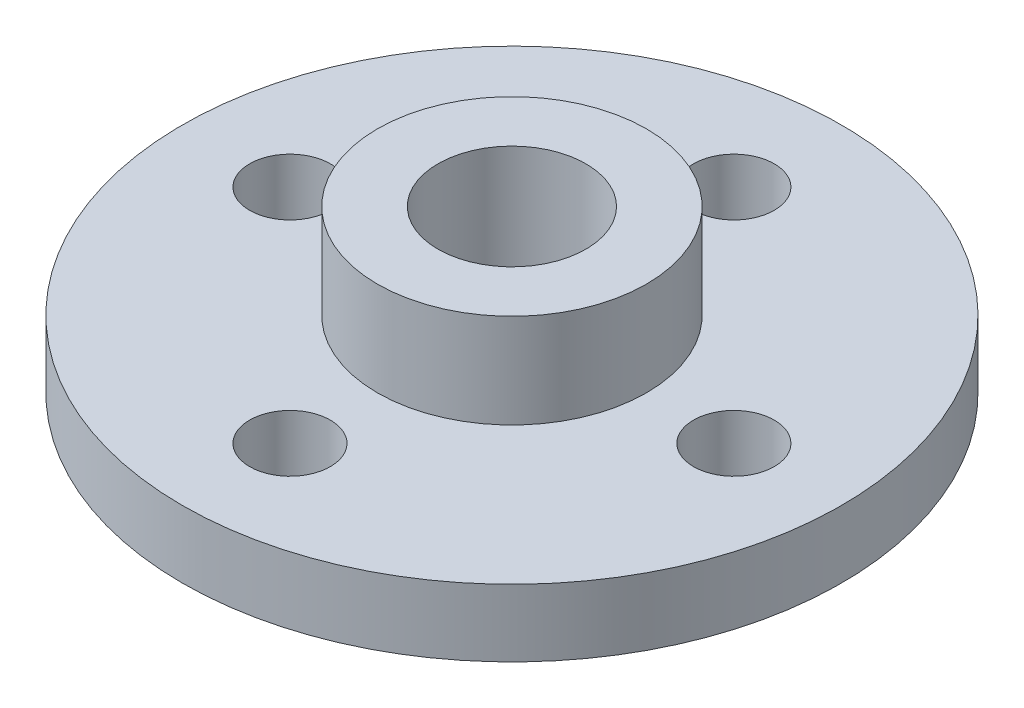
ISO-10303-21;
HEADER;
FILE_DESCRIPTION(('STEP AP214'),'2;1');
FILE_NAME('part.step','',(''),(''),'','','');
FILE_SCHEMA(('AUTOMOTIVE_DESIGN { 1 0 10303 214 1 1 1 1 }'));
ENDSEC;
DATA;
#1=APPLICATION_CONTEXT('core data for automotive mechanical design processes');
#2=APPLICATION_PROTOCOL_DEFINITION('international standard','automotive_design',2000,#1);
#3=PRODUCT_CONTEXT('',#1,'mechanical');
#4=PRODUCT('Part','Part','',(#3));
#5=PRODUCT_RELATED_PRODUCT_CATEGORY('part','',(#4));
#6=PRODUCT_DEFINITION_FORMATION('','',#4);
#7=PRODUCT_DEFINITION_CONTEXT('part definition',#1,'design');
#8=PRODUCT_DEFINITION('design','',#6,#7);
#9=PRODUCT_DEFINITION_SHAPE('','',#8);
#10=(LENGTH_UNIT() NAMED_UNIT(*) SI_UNIT(.MILLI.,.METRE.));
#11=(NAMED_UNIT(*) PLANE_ANGLE_UNIT() SI_UNIT($,.RADIAN.));
#12=(NAMED_UNIT(*) SI_UNIT($,.STERADIAN.) SOLID_ANGLE_UNIT());
#13=UNCERTAINTY_MEASURE_WITH_UNIT(LENGTH_MEASURE(1.E-05),#10,'distance_accuracy_value','');
#14=(GEOMETRIC_REPRESENTATION_CONTEXT(3) GLOBAL_UNCERTAINTY_ASSIGNED_CONTEXT((#13)) GLOBAL_UNIT_ASSIGNED_CONTEXT((#10,
#11,#12)) REPRESENTATION_CONTEXT('',''));
#15=CARTESIAN_POINT('',(0.,0.,0.));
#16=DIRECTION('',(0.,0.,1.));
#17=DIRECTION('',(1.,0.,0.));
#18=AXIS2_PLACEMENT_3D('',#15,#16,#17);
#19=CARTESIAN_POINT('',(0.,6.,0.));
#20=DIRECTION('',(0.,-1.,0.));
#21=DIRECTION('',(0.,0.,-1.));
#22=AXIS2_PLACEMENT_3D('',#19,#20,#21);
#23=CYLINDRICAL_SURFACE('',#22,1.5);
#24=CARTESIAN_POINT('',(0.,0.,0.));
#25=DIRECTION('',(0.,1.,0.));
#26=DIRECTION('',(0.,0.,1.));
#27=AXIS2_PLACEMENT_3D('',#24,#25,#26);
#28=CIRCLE('',#27,1.5);
#29=CARTESIAN_POINT('',(0.,0.,1.5));
#30=VERTEX_POINT('',#29);
#31=EDGE_CURVE('E64',#30,#30,#28,.T.);
#32=ORIENTED_EDGE('',*,*,#31,.F.);
#33=EDGE_LOOP('',(#32));
#34=FACE_BOUND('',#33,.T.);
#35=CARTESIAN_POINT('',(0.,2.,0.));
#36=DIRECTION('',(0.,1.,0.));
#37=DIRECTION('',(0.,0.,1.));
#38=AXIS2_PLACEMENT_3D('',#35,#36,#37);
#39=CIRCLE('',#38,1.5);
#40=CARTESIAN_POINT('',(0.,2.,1.5));
#41=VERTEX_POINT('',#40);
#42=EDGE_CURVE('E36',#41,#41,#39,.T.);
#43=ORIENTED_EDGE('',*,*,#42,.T.);
#44=EDGE_LOOP('',(#43));
#45=FACE_BOUND('',#44,.T.);
#46=ADVANCED_FACE('F32',(#34,#45),#23,.F.);
#47=CARTESIAN_POINT('',(0.,2.5,0.));
#48=DIRECTION('',(0.,-1.,0.));
#49=DIRECTION('',(0.,0.,-1.));
#50=AXIS2_PLACEMENT_3D('',#47,#48,#49);
#51=CYLINDRICAL_SURFACE('',#50,12.25);
#52=CARTESIAN_POINT('',(0.,2.5,0.));
#53=DIRECTION('',(0.,1.,0.));
#54=DIRECTION('',(0.,0.,1.));
#55=AXIS2_PLACEMENT_3D('',#52,#53,#54);
#56=CIRCLE('',#55,12.25);
#57=CARTESIAN_POINT('',(0.,2.5,12.25));
#58=VERTEX_POINT('',#57);
#59=EDGE_CURVE('E10',#58,#58,#56,.T.);
#60=ORIENTED_EDGE('',*,*,#59,.F.);
#61=EDGE_LOOP('',(#60));
#62=FACE_BOUND('',#61,.T.);
#63=CARTESIAN_POINT('',(0.,0.,0.));
#64=DIRECTION('',(0.,1.,0.));
#65=DIRECTION('',(0.,0.,1.));
#66=AXIS2_PLACEMENT_3D('',#63,#64,#65);
#67=CIRCLE('',#66,12.25);
#68=CARTESIAN_POINT('',(0.,0.,12.25));
#69=VERTEX_POINT('',#68);
#70=EDGE_CURVE('E40',#69,#69,#67,.T.);
#71=ORIENTED_EDGE('',*,*,#70,.T.);
#72=EDGE_LOOP('',(#71));
#73=FACE_BOUND('',#72,.T.);
#74=ADVANCED_FACE('F34',(#62,#73),#51,.T.);
#75=CARTESIAN_POINT('',(0.,2.5,0.));
#76=DIRECTION('',(0.,1.,0.));
#77=DIRECTION('',(0.,0.,1.));
#78=AXIS2_PLACEMENT_3D('',#75,#76,#77);
#79=PLANE('',#78);
#80=CARTESIAN_POINT('',(-8.25,2.5,0.));
#81=DIRECTION('',(0.,1.,0.));
#82=DIRECTION('',(0.,0.,1.));
#83=AXIS2_PLACEMENT_3D('',#80,#81,#82);
#84=CIRCLE('',#83,1.5);
#85=CARTESIAN_POINT('',(-8.25,2.5,1.5));
#86=VERTEX_POINT('',#85);
#87=EDGE_CURVE('E52',#86,#86,#84,.F.);
#88=ORIENTED_EDGE('',*,*,#87,.T.);
#89=EDGE_LOOP('',(#88));
#90=FACE_BOUND('',#89,.T.);
#91=CARTESIAN_POINT('',(0.,2.5,-8.25));
#92=DIRECTION('',(0.,1.,0.));
#93=DIRECTION('',(0.,0.,1.));
#94=AXIS2_PLACEMENT_3D('',#91,#92,#93);
#95=CIRCLE('',#94,1.5);
#96=CARTESIAN_POINT('',(0.,2.5,-6.75));
#97=VERTEX_POINT('',#96);
#98=EDGE_CURVE('E55',#97,#97,#95,.F.);
#99=ORIENTED_EDGE('',*,*,#98,.T.);
#100=EDGE_LOOP('',(#99));
#101=FACE_BOUND('',#100,.T.);
#102=CARTESIAN_POINT('',(8.25,2.5,0.));
#103=DIRECTION('',(0.,1.,0.));
#104=DIRECTION('',(0.,0.,1.));
#105=AXIS2_PLACEMENT_3D('',#102,#103,#104);
#106=CIRCLE('',#105,1.5);
#107=CARTESIAN_POINT('',(8.25,2.5,1.5));
#108=VERTEX_POINT('',#107);
#109=EDGE_CURVE('E58',#108,#108,#106,.F.);
#110=ORIENTED_EDGE('',*,*,#109,.T.);
#111=EDGE_LOOP('',(#110));
#112=FACE_BOUND('',#111,.T.);
#113=CARTESIAN_POINT('',(0.,2.5,8.25));
#114=DIRECTION('',(0.,1.,0.));
#115=DIRECTION('',(0.,0.,1.));
#116=AXIS2_PLACEMENT_3D('',#113,#114,#115);
#117=CIRCLE('',#116,1.5);
#118=CARTESIAN_POINT('',(0.,2.5,9.75));
#119=VERTEX_POINT('',#118);
#120=EDGE_CURVE('E61',#119,#119,#117,.F.);
#121=ORIENTED_EDGE('',*,*,#120,.T.);
#122=EDGE_LOOP('',(#121));
#123=FACE_BOUND('',#122,.T.);
#124=CARTESIAN_POINT('',(0.,2.5,0.));
#125=DIRECTION('',(0.,1.,0.));
#126=DIRECTION('',(0.,0.,1.));
#127=AXIS2_PLACEMENT_3D('',#124,#125,#126);
#128=CIRCLE('',#127,5.);
#129=CARTESIAN_POINT('',(0.,2.5,5.));
#130=VERTEX_POINT('',#129);
#131=EDGE_CURVE('E45',#130,#130,#128,.F.);
#132=ORIENTED_EDGE('',*,*,#131,.T.);
#133=EDGE_LOOP('',(#132));
#134=FACE_BOUND('',#133,.T.);
#135=ORIENTED_EDGE('',*,*,#59,.T.);
#136=EDGE_LOOP('',(#135));
#137=FACE_BOUND('',#136,.T.);
#138=ADVANCED_FACE('F106',(#90,#101,#112,#123,#134,#137),#79,.T.);
#139=CARTESIAN_POINT('',(0.,0.,0.));
#140=DIRECTION('',(0.,1.,0.));
#141=DIRECTION('',(0.,0.,1.));
#142=AXIS2_PLACEMENT_3D('',#139,#140,#141);
#143=PLANE('',#142);
#144=CARTESIAN_POINT('',(-8.25,0.,0.));
#145=DIRECTION('',(0.,1.,0.));
#146=DIRECTION('',(0.,0.,1.));
#147=AXIS2_PLACEMENT_3D('',#144,#145,#146);
#148=CIRCLE('',#147,1.5);
#149=CARTESIAN_POINT('',(-8.25,0.,1.5));
#150=VERTEX_POINT('',#149);
#151=EDGE_CURVE('E67',#150,#150,#148,.T.);
#152=ORIENTED_EDGE('',*,*,#151,.T.);
#153=EDGE_LOOP('',(#152));
#154=FACE_BOUND('',#153,.T.);
#155=CARTESIAN_POINT('',(0.,0.,-8.25));
#156=DIRECTION('',(0.,1.,0.));
#157=DIRECTION('',(0.,0.,1.));
#158=AXIS2_PLACEMENT_3D('',#155,#156,#157);
#159=CIRCLE('',#158,1.5);
#160=CARTESIAN_POINT('',(0.,0.,-6.75));
#161=VERTEX_POINT('',#160);
#162=EDGE_CURVE('E68',#161,#161,#159,.T.);
#163=ORIENTED_EDGE('',*,*,#162,.T.);
#164=EDGE_LOOP('',(#163));
#165=FACE_BOUND('',#164,.T.);
#166=CARTESIAN_POINT('',(8.25,0.,0.));
#167=DIRECTION('',(0.,1.,0.));
#168=DIRECTION('',(0.,0.,1.));
#169=AXIS2_PLACEMENT_3D('',#166,#167,#168);
#170=CIRCLE('',#169,1.5);
#171=CARTESIAN_POINT('',(8.25,0.,1.5));
#172=VERTEX_POINT('',#171);
#173=EDGE_CURVE('E71',#172,#172,#170,.T.);
#174=ORIENTED_EDGE('',*,*,#173,.T.);
#175=EDGE_LOOP('',(#174));
#176=FACE_BOUND('',#175,.T.);
#177=CARTESIAN_POINT('',(0.,0.,8.25));
#178=DIRECTION('',(0.,1.,0.));
#179=DIRECTION('',(0.,0.,1.));
#180=AXIS2_PLACEMENT_3D('',#177,#178,#179);
#181=CIRCLE('',#180,1.5);
#182=CARTESIAN_POINT('',(0.,0.,9.75));
#183=VERTEX_POINT('',#182);
#184=EDGE_CURVE('E74',#183,#183,#181,.T.);
#185=ORIENTED_EDGE('',*,*,#184,.T.);
#186=EDGE_LOOP('',(#185));
#187=FACE_BOUND('',#186,.T.);
#188=ORIENTED_EDGE('',*,*,#31,.T.);
#189=EDGE_LOOP('',(#188));
#190=FACE_BOUND('',#189,.T.);
#191=ORIENTED_EDGE('',*,*,#70,.F.);
#192=EDGE_LOOP('',(#191));
#193=FACE_BOUND('',#192,.T.);
#194=ADVANCED_FACE('F121',(#154,#165,#176,#187,#190,#193),#143,.F.);
#195=CARTESIAN_POINT('',(0.,6.,0.));
#196=DIRECTION('',(0.,-1.,0.));
#197=DIRECTION('',(0.,0.,-1.));
#198=AXIS2_PLACEMENT_3D('',#195,#196,#197);
#199=CYLINDRICAL_SURFACE('',#198,5.);
#200=ORIENTED_EDGE('',*,*,#131,.F.);
#201=EDGE_LOOP('',(#200));
#202=FACE_BOUND('',#201,.T.);
#203=CARTESIAN_POINT('',(0.,6.,0.));
#204=DIRECTION('',(0.,1.,0.));
#205=DIRECTION('',(0.,0.,1.));
#206=AXIS2_PLACEMENT_3D('',#203,#204,#205);
#207=CIRCLE('',#206,5.);
#208=CARTESIAN_POINT('',(0.,6.,5.));
#209=VERTEX_POINT('',#208);
#210=EDGE_CURVE('E49',#209,#209,#207,.T.);
#211=ORIENTED_EDGE('',*,*,#210,.F.);
#212=EDGE_LOOP('',(#211));
#213=FACE_BOUND('',#212,.T.);
#214=ADVANCED_FACE('F117',(#202,#213),#199,.T.);
#215=CARTESIAN_POINT('',(0.,6.,0.));
#216=DIRECTION('',(0.,1.,0.));
#217=DIRECTION('',(0.,0.,1.));
#218=AXIS2_PLACEMENT_3D('',#215,#216,#217);
#219=PLANE('',#218);
#220=CARTESIAN_POINT('',(0.,6.,0.));
#221=DIRECTION('',(0.,1.,0.));
#222=DIRECTION('',(0.,0.,1.));
#223=AXIS2_PLACEMENT_3D('',#220,#221,#222);
#224=CIRCLE('',#223,2.75);
#225=CARTESIAN_POINT('',(0.,6.,2.75));
#226=VERTEX_POINT('',#225);
#227=EDGE_CURVE('E79',#226,#226,#224,.T.);
#228=ORIENTED_EDGE('',*,*,#227,.F.);
#229=EDGE_LOOP('',(#228));
#230=FACE_BOUND('',#229,.T.);
#231=ORIENTED_EDGE('',*,*,#210,.T.);
#232=EDGE_LOOP('',(#231));
#233=FACE_BOUND('',#232,.T.);
#234=ADVANCED_FACE('F113',(#230,#233),#219,.T.);
#235=CARTESIAN_POINT('',(0.,6.,8.25));
#236=DIRECTION('',(0.,-1.,0.));
#237=DIRECTION('',(0.,0.,-1.));
#238=AXIS2_PLACEMENT_3D('',#235,#236,#237);
#239=CYLINDRICAL_SURFACE('',#238,1.5);
#240=ORIENTED_EDGE('',*,*,#120,.F.);
#241=EDGE_LOOP('',(#240));
#242=FACE_BOUND('',#241,.T.);
#243=ORIENTED_EDGE('',*,*,#184,.F.);
#244=EDGE_LOOP('',(#243));
#245=FACE_BOUND('',#244,.T.);
#246=ADVANCED_FACE('F116',(#242,#245),#239,.F.);
#247=CARTESIAN_POINT('',(8.25,6.,0.));
#248=DIRECTION('',(0.,-1.,0.));
#249=DIRECTION('',(0.,0.,-1.));
#250=AXIS2_PLACEMENT_3D('',#247,#248,#249);
#251=CYLINDRICAL_SURFACE('',#250,1.5);
#252=ORIENTED_EDGE('',*,*,#109,.F.);
#253=EDGE_LOOP('',(#252));
#254=FACE_BOUND('',#253,.T.);
#255=ORIENTED_EDGE('',*,*,#173,.F.);
#256=EDGE_LOOP('',(#255));
#257=FACE_BOUND('',#256,.T.);
#258=ADVANCED_FACE('F142',(#254,#257),#251,.F.);
#259=CARTESIAN_POINT('',(0.,6.,-8.25));
#260=DIRECTION('',(0.,-1.,0.));
#261=DIRECTION('',(0.,0.,-1.));
#262=AXIS2_PLACEMENT_3D('',#259,#260,#261);
#263=CYLINDRICAL_SURFACE('',#262,1.5);
#264=ORIENTED_EDGE('',*,*,#98,.F.);
#265=EDGE_LOOP('',(#264));
#266=FACE_BOUND('',#265,.T.);
#267=ORIENTED_EDGE('',*,*,#162,.F.);
#268=EDGE_LOOP('',(#267));
#269=FACE_BOUND('',#268,.T.);
#270=ADVANCED_FACE('F111',(#266,#269),#263,.F.);
#271=CARTESIAN_POINT('',(-8.25,6.,0.));
#272=DIRECTION('',(0.,-1.,0.));
#273=DIRECTION('',(0.,0.,-1.));
#274=AXIS2_PLACEMENT_3D('',#271,#272,#273);
#275=CYLINDRICAL_SURFACE('',#274,1.5);
#276=ORIENTED_EDGE('',*,*,#87,.F.);
#277=EDGE_LOOP('',(#276));
#278=FACE_BOUND('',#277,.T.);
#279=ORIENTED_EDGE('',*,*,#151,.F.);
#280=EDGE_LOOP('',(#279));
#281=FACE_BOUND('',#280,.T.);
#282=ADVANCED_FACE('F97',(#278,#281),#275,.F.);
#283=CARTESIAN_POINT('',(0.,2.,0.));
#284=DIRECTION('',(0.,1.,0.));
#285=DIRECTION('',(0.,0.,1.));
#286=AXIS2_PLACEMENT_3D('',#283,#284,#285);
#287=CYLINDRICAL_SURFACE('',#286,2.75);
#288=CARTESIAN_POINT('',(0.,2.,0.));
#289=DIRECTION('',(0.,1.,0.));
#290=DIRECTION('',(0.,0.,1.));
#291=AXIS2_PLACEMENT_3D('',#288,#289,#290);
#292=CIRCLE('',#291,2.75);
#293=CARTESIAN_POINT('',(0.,2.,2.75));
#294=VERTEX_POINT('',#293);
#295=EDGE_CURVE('E82',#294,#294,#292,.T.);
#296=ORIENTED_EDGE('',*,*,#295,.F.);
#297=EDGE_LOOP('',(#296));
#298=FACE_BOUND('',#297,.T.);
#299=ORIENTED_EDGE('',*,*,#227,.T.);
#300=EDGE_LOOP('',(#299));
#301=FACE_BOUND('',#300,.T.);
#302=ADVANCED_FACE('F92',(#298,#301),#287,.F.);
#303=CARTESIAN_POINT('',(0.,2.,0.));
#304=DIRECTION('',(0.,1.,0.));
#305=DIRECTION('',(0.,0.,1.));
#306=AXIS2_PLACEMENT_3D('',#303,#304,#305);
#307=PLANE('',#306);
#308=ORIENTED_EDGE('',*,*,#42,.F.);
#309=EDGE_LOOP('',(#308));
#310=FACE_BOUND('',#309,.T.);
#311=ORIENTED_EDGE('',*,*,#295,.T.);
#312=EDGE_LOOP('',(#311));
#313=FACE_BOUND('',#312,.T.);
#314=ADVANCED_FACE('F90',(#310,#313),#307,.T.);
#315=CLOSED_SHELL('',(#46,#74,#138,#194,#214,#234,#246,#258,#270,#282,#302,#314));
#316=MANIFOLD_SOLID_BREP('B2',#315);
#317=ADVANCED_BREP_SHAPE_REPRESENTATION('',(#18,#316),#14);
#318=SHAPE_DEFINITION_REPRESENTATION(#9,#317);
ENDSEC;
END-ISO-10303-21;
